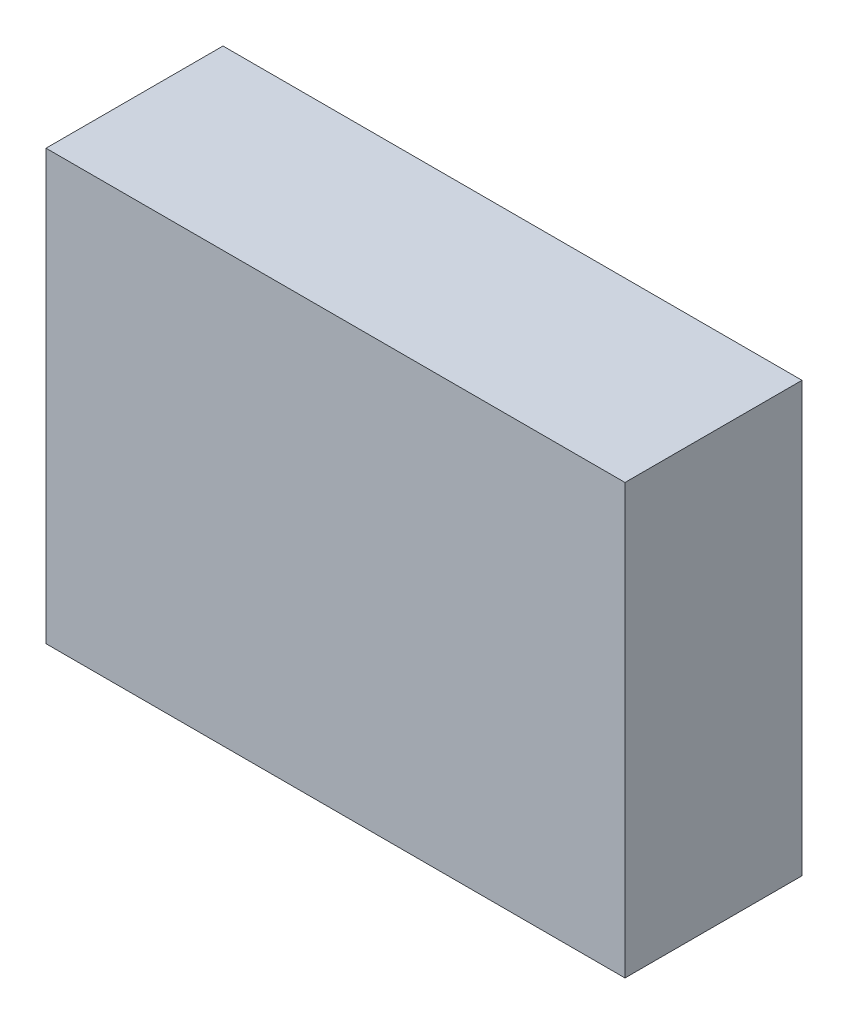
ISO-10303-21;
HEADER;
FILE_DESCRIPTION(('STEP AP214'),'2;1');
FILE_NAME('part.step','',(''),(''),'','','');
FILE_SCHEMA(('AUTOMOTIVE_DESIGN { 1 0 10303 214 1 1 1 1 }'));
ENDSEC;
DATA;
#1=APPLICATION_CONTEXT('core data for automotive mechanical design processes');
#2=APPLICATION_PROTOCOL_DEFINITION('international standard','automotive_design',2000,#1);
#3=PRODUCT_CONTEXT('',#1,'mechanical');
#4=PRODUCT('Part','Part','',(#3));
#5=PRODUCT_RELATED_PRODUCT_CATEGORY('part','',(#4));
#6=PRODUCT_DEFINITION_FORMATION('','',#4);
#7=PRODUCT_DEFINITION_CONTEXT('part definition',#1,'design');
#8=PRODUCT_DEFINITION('design','',#6,#7);
#9=PRODUCT_DEFINITION_SHAPE('','',#8);
#10=(LENGTH_UNIT() NAMED_UNIT(*) SI_UNIT(.MILLI.,.METRE.));
#11=(NAMED_UNIT(*) PLANE_ANGLE_UNIT() SI_UNIT($,.RADIAN.));
#12=(NAMED_UNIT(*) SI_UNIT($,.STERADIAN.) SOLID_ANGLE_UNIT());
#13=UNCERTAINTY_MEASURE_WITH_UNIT(LENGTH_MEASURE(1.E-05),#10,'distance_accuracy_value','');
#14=(GEOMETRIC_REPRESENTATION_CONTEXT(3) GLOBAL_UNCERTAINTY_ASSIGNED_CONTEXT((#13)) GLOBAL_UNIT_ASSIGNED_CONTEXT((#10,
#11,#12)) REPRESENTATION_CONTEXT('',''));
#15=CARTESIAN_POINT('',(0.,0.,0.));
#16=DIRECTION('',(0.,0.,1.));
#17=DIRECTION('',(1.,0.,0.));
#18=AXIS2_PLACEMENT_3D('',#15,#16,#17);
#19=CARTESIAN_POINT('',(0.,0.,15.));
#20=DIRECTION('',(1.,0.,0.));
#21=DIRECTION('',(0.,0.,-1.));
#22=AXIS2_PLACEMENT_3D('',#19,#20,#21);
#23=PLANE('',#22);
#24=DIRECTION('',(0.,-1.,0.));
#25=VECTOR('',#24,1.);
#26=CARTESIAN_POINT('',(0.,0.,0.));
#27=LINE('',#26,#25);
#28=CARTESIAN_POINT('',(0.,36.3682338884721,0.));
#29=VERTEX_POINT('',#28);
#30=CARTESIAN_POINT('',(0.,0.,0.));
#31=VERTEX_POINT('',#30);
#32=EDGE_CURVE('E107',#29,#31,#27,.T.);
#33=ORIENTED_EDGE('',*,*,#32,.T.);
#34=DIRECTION('',(0.,0.,-1.));
#35=VECTOR('',#34,1.);
#36=CARTESIAN_POINT('',(0.,0.,15.));
#37=LINE('',#36,#35);
#38=CARTESIAN_POINT('',(0.,0.,15.));
#39=VERTEX_POINT('',#38);
#40=EDGE_CURVE('E11',#39,#31,#37,.T.);
#41=ORIENTED_EDGE('',*,*,#40,.F.);
#42=DIRECTION('',(0.,-1.,0.));
#43=VECTOR('',#42,1.);
#44=CARTESIAN_POINT('',(0.,0.,15.));
#45=LINE('',#44,#43);
#46=CARTESIAN_POINT('',(0.,36.3682338884721,15.));
#47=VERTEX_POINT('',#46);
#48=EDGE_CURVE('E91',#47,#39,#45,.T.);
#49=ORIENTED_EDGE('',*,*,#48,.F.);
#50=DIRECTION('',(0.,0.,-1.));
#51=VECTOR('',#50,1.);
#52=CARTESIAN_POINT('',(0.,36.3682338884721,15.));
#53=LINE('',#52,#51);
#54=EDGE_CURVE('E103',#47,#29,#53,.T.);
#55=ORIENTED_EDGE('',*,*,#54,.T.);
#56=EDGE_LOOP('',(#33,#41,#49,#55));
#57=FACE_BOUND('',#56,.T.);
#58=ADVANCED_FACE('F39',(#57),#23,.F.);
#59=CARTESIAN_POINT('',(0.,0.,15.));
#60=DIRECTION('',(0.,1.,0.));
#61=DIRECTION('',(0.,0.,1.));
#62=AXIS2_PLACEMENT_3D('',#59,#60,#61);
#63=PLANE('',#62);
#64=DIRECTION('',(1.,0.,0.));
#65=VECTOR('',#64,1.);
#66=CARTESIAN_POINT('',(0.,0.,0.));
#67=LINE('',#66,#65);
#68=CARTESIAN_POINT('',(49.068252071748,0.,0.));
#69=VERTEX_POINT('',#68);
#70=EDGE_CURVE('E96',#31,#69,#67,.T.);
#71=ORIENTED_EDGE('',*,*,#70,.T.);
#72=DIRECTION('',(0.,0.,-1.));
#73=VECTOR('',#72,1.);
#74=CARTESIAN_POINT('',(49.068252071748,0.,15.));
#75=LINE('',#74,#73);
#76=CARTESIAN_POINT('',(49.068252071748,0.,15.));
#77=VERTEX_POINT('',#76);
#78=EDGE_CURVE('E48',#77,#69,#75,.T.);
#79=ORIENTED_EDGE('',*,*,#78,.F.);
#80=DIRECTION('',(1.,0.,0.));
#81=VECTOR('',#80,1.);
#82=CARTESIAN_POINT('',(0.,0.,15.));
#83=LINE('',#82,#81);
#84=EDGE_CURVE('E86',#39,#77,#83,.T.);
#85=ORIENTED_EDGE('',*,*,#84,.F.);
#86=ORIENTED_EDGE('',*,*,#40,.T.);
#87=EDGE_LOOP('',(#71,#79,#85,#86));
#88=FACE_BOUND('',#87,.T.);
#89=ADVANCED_FACE('F95',(#88),#63,.F.);
#90=CARTESIAN_POINT('',(49.068252071748,0.,15.));
#91=DIRECTION('',(-1.,0.,0.));
#92=DIRECTION('',(0.,0.,1.));
#93=AXIS2_PLACEMENT_3D('',#90,#91,#92);
#94=PLANE('',#93);
#95=DIRECTION('',(0.,1.,0.));
#96=VECTOR('',#95,1.);
#97=CARTESIAN_POINT('',(49.068252071748,0.,0.));
#98=LINE('',#97,#96);
#99=CARTESIAN_POINT('',(49.068252071748,36.3682338884721,0.));
#100=VERTEX_POINT('',#99);
#101=EDGE_CURVE('E73',#69,#100,#98,.T.);
#102=ORIENTED_EDGE('',*,*,#101,.T.);
#103=DIRECTION('',(0.,0.,-1.));
#104=VECTOR('',#103,1.);
#105=CARTESIAN_POINT('',(49.068252071748,36.3682338884721,15.));
#106=LINE('',#105,#104);
#107=CARTESIAN_POINT('',(49.068252071748,36.3682338884721,15.));
#108=VERTEX_POINT('',#107);
#109=EDGE_CURVE('E98',#108,#100,#106,.T.);
#110=ORIENTED_EDGE('',*,*,#109,.F.);
#111=DIRECTION('',(0.,1.,0.));
#112=VECTOR('',#111,1.);
#113=CARTESIAN_POINT('',(49.068252071748,0.,15.));
#114=LINE('',#113,#112);
#115=EDGE_CURVE('E89',#77,#108,#114,.T.);
#116=ORIENTED_EDGE('',*,*,#115,.F.);
#117=ORIENTED_EDGE('',*,*,#78,.T.);
#118=EDGE_LOOP('',(#102,#110,#116,#117));
#119=FACE_BOUND('',#118,.T.);
#120=ADVANCED_FACE('F99',(#119),#94,.F.);
#121=CARTESIAN_POINT('',(0.,36.3682338884721,15.));
#122=DIRECTION('',(0.,-1.,0.));
#123=DIRECTION('',(0.,0.,-1.));
#124=AXIS2_PLACEMENT_3D('',#121,#122,#123);
#125=PLANE('',#124);
#126=DIRECTION('',(-1.,0.,0.));
#127=VECTOR('',#126,1.);
#128=CARTESIAN_POINT('',(0.,36.3682338884721,0.));
#129=LINE('',#128,#127);
#130=EDGE_CURVE('E79',#100,#29,#129,.T.);
#131=ORIENTED_EDGE('',*,*,#130,.T.);
#132=ORIENTED_EDGE('',*,*,#54,.F.);
#133=DIRECTION('',(-1.,0.,0.));
#134=VECTOR('',#133,1.);
#135=CARTESIAN_POINT('',(0.,36.3682338884721,15.));
#136=LINE('',#135,#134);
#137=EDGE_CURVE('E56',#108,#47,#136,.T.);
#138=ORIENTED_EDGE('',*,*,#137,.F.);
#139=ORIENTED_EDGE('',*,*,#109,.T.);
#140=EDGE_LOOP('',(#131,#132,#138,#139));
#141=FACE_BOUND('',#140,.T.);
#142=ADVANCED_FACE('F120',(#141),#125,.F.);
#143=CARTESIAN_POINT('',(0.,0.,15.));
#144=DIRECTION('',(0.,0.,-1.));
#145=DIRECTION('',(-1.,0.,0.));
#146=AXIS2_PLACEMENT_3D('',#143,#144,#145);
#147=PLANE('',#146);
#148=ORIENTED_EDGE('',*,*,#48,.T.);
#149=ORIENTED_EDGE('',*,*,#84,.T.);
#150=ORIENTED_EDGE('',*,*,#115,.T.);
#151=ORIENTED_EDGE('',*,*,#137,.T.);
#152=EDGE_LOOP('',(#148,#149,#150,#151));
#153=FACE_BOUND('',#152,.T.);
#154=ADVANCED_FACE('F87',(#153),#147,.F.);
#155=CARTESIAN_POINT('',(0.,0.,0.));
#156=DIRECTION('',(0.,0.,-1.));
#157=DIRECTION('',(-1.,0.,0.));
#158=AXIS2_PLACEMENT_3D('',#155,#156,#157);
#159=PLANE('',#158);
#160=ORIENTED_EDGE('',*,*,#32,.F.);
#161=ORIENTED_EDGE('',*,*,#130,.F.);
#162=ORIENTED_EDGE('',*,*,#101,.F.);
#163=ORIENTED_EDGE('',*,*,#70,.F.);
#164=EDGE_LOOP('',(#160,#161,#162,#163));
#165=FACE_BOUND('',#164,.T.);
#166=ADVANCED_FACE('F123',(#165),#159,.T.);
#167=CLOSED_SHELL('',(#58,#89,#120,#142,#154,#166));
#168=MANIFOLD_SOLID_BREP('B2',#167);
#169=ADVANCED_BREP_SHAPE_REPRESENTATION('',(#18,#168),#14);
#170=SHAPE_DEFINITION_REPRESENTATION(#9,#169);
ENDSEC;
END-ISO-10303-21;
